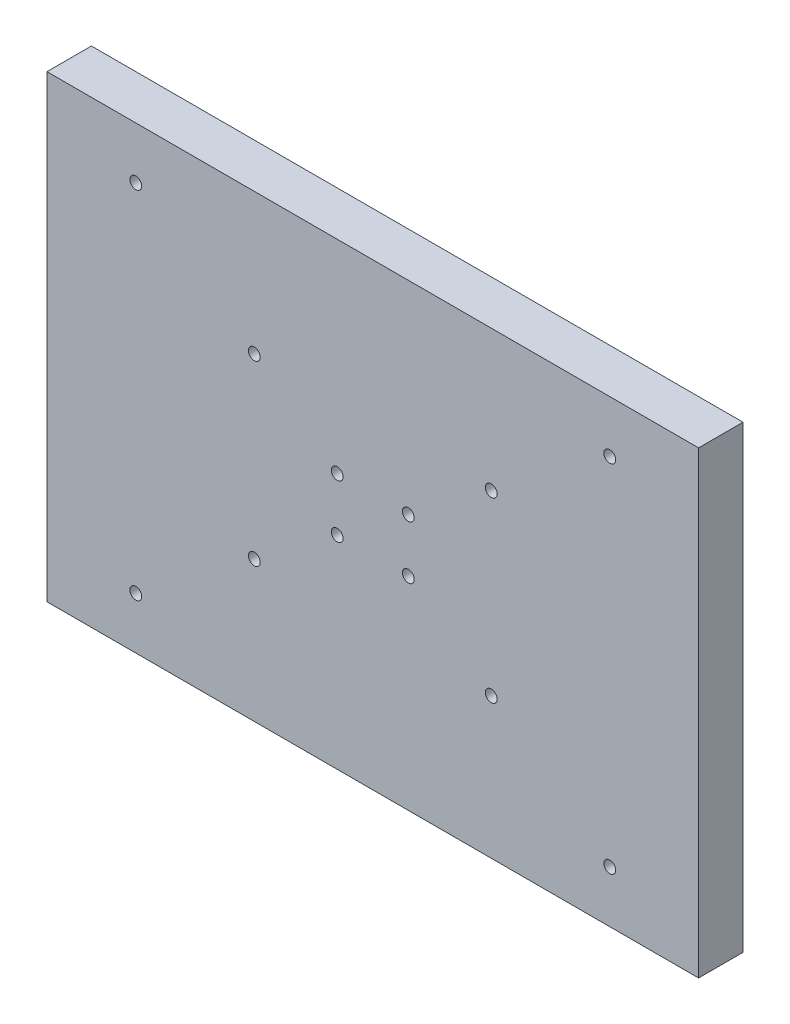
ISO-10303-21;
HEADER;
FILE_DESCRIPTION(('STEP AP214'),'2;1');
FILE_NAME('part.step','',(''),(''),'','','');
FILE_SCHEMA(('AUTOMOTIVE_DESIGN { 1 0 10303 214 1 1 1 1 }'));
ENDSEC;
DATA;
#1=APPLICATION_CONTEXT('core data for automotive mechanical design processes');
#2=APPLICATION_PROTOCOL_DEFINITION('international standard','automotive_design',2000,#1);
#3=PRODUCT_CONTEXT('',#1,'mechanical');
#4=PRODUCT('Part','Part','',(#3));
#5=PRODUCT_RELATED_PRODUCT_CATEGORY('part','',(#4));
#6=PRODUCT_DEFINITION_FORMATION('','',#4);
#7=PRODUCT_DEFINITION_CONTEXT('part definition',#1,'design');
#8=PRODUCT_DEFINITION('design','',#6,#7);
#9=PRODUCT_DEFINITION_SHAPE('','',#8);
#10=(LENGTH_UNIT() NAMED_UNIT(*) SI_UNIT(.MILLI.,.METRE.));
#11=(NAMED_UNIT(*) PLANE_ANGLE_UNIT() SI_UNIT($,.RADIAN.));
#12=(NAMED_UNIT(*) SI_UNIT($,.STERADIAN.) SOLID_ANGLE_UNIT());
#13=UNCERTAINTY_MEASURE_WITH_UNIT(LENGTH_MEASURE(1.E-05),#10,'distance_accuracy_value','');
#14=(GEOMETRIC_REPRESENTATION_CONTEXT(3) GLOBAL_UNCERTAINTY_ASSIGNED_CONTEXT((#13)) GLOBAL_UNIT_ASSIGNED_CONTEXT((#10,
#11,#12)) REPRESENTATION_CONTEXT('',''));
#15=CARTESIAN_POINT('',(0.,0.,0.));
#16=DIRECTION('',(0.,0.,1.));
#17=DIRECTION('',(1.,0.,0.));
#18=AXIS2_PLACEMENT_3D('',#15,#16,#17);
#19=CARTESIAN_POINT('',(0.,0.,15.));
#20=DIRECTION('',(0.,0.,-1.));
#21=DIRECTION('',(-1.,0.,0.));
#22=AXIS2_PLACEMENT_3D('',#19,#20,#21);
#23=PLANE('',#22);
#24=DIRECTION('',(0.,-1.,0.));
#25=VECTOR('',#24,1.);
#26=CARTESIAN_POINT('',(-437.751680005346,-129.877216900672,15.));
#27=LINE('',#26,#25);
#28=CARTESIAN_POINT('',(-437.751680005346,25.1227830993275,15.));
#29=VERTEX_POINT('',#28);
#30=CARTESIAN_POINT('',(-437.751680005346,-129.877216900672,15.));
#31=VERTEX_POINT('',#30);
#32=EDGE_CURVE('E94',#29,#31,#27,.T.);
#33=ORIENTED_EDGE('',*,*,#32,.T.);
#34=DIRECTION('',(1.,0.,0.));
#35=VECTOR('',#34,1.);
#36=CARTESIAN_POINT('',(-437.751680005346,-129.877216900672,15.));
#37=LINE('',#36,#35);
#38=CARTESIAN_POINT('',(-217.751680005346,-129.877216900672,15.));
#39=VERTEX_POINT('',#38);
#40=EDGE_CURVE('E89',#31,#39,#37,.T.);
#41=ORIENTED_EDGE('',*,*,#40,.T.);
#42=DIRECTION('',(0.,1.,0.));
#43=VECTOR('',#42,1.);
#44=CARTESIAN_POINT('',(-217.751680005346,-129.877216900672,15.));
#45=LINE('',#44,#43);
#46=CARTESIAN_POINT('',(-217.751680005346,25.1227830993275,15.));
#47=VERTEX_POINT('',#46);
#48=EDGE_CURVE('E92',#39,#47,#45,.T.);
#49=ORIENTED_EDGE('',*,*,#48,.T.);
#50=DIRECTION('',(-1.,0.,0.));
#51=VECTOR('',#50,1.);
#52=CARTESIAN_POINT('',(-437.751680005346,25.1227830993275,15.));
#53=LINE('',#52,#51);
#54=EDGE_CURVE('E59',#47,#29,#53,.T.);
#55=ORIENTED_EDGE('',*,*,#54,.T.);
#56=EDGE_LOOP('',(#33,#41,#49,#55));
#57=FACE_BOUND('',#56,.T.);
#58=CARTESIAN_POINT('',(-247.751680005346,-112.377216900672,15.));
#59=DIRECTION('',(0.,0.,1.));
#60=DIRECTION('',(1.,0.,0.));
#61=AXIS2_PLACEMENT_3D('',#58,#59,#60);
#62=CIRCLE('',#61,2.);
#63=CARTESIAN_POINT('',(-245.751680005346,-112.377216900672,15.));
#64=VERTEX_POINT('',#63);
#65=EDGE_CURVE('E109',#64,#64,#62,.T.);
#66=ORIENTED_EDGE('',*,*,#65,.F.);
#67=EDGE_LOOP('',(#66));
#68=FACE_BOUND('',#67,.T.);
#69=CARTESIAN_POINT('',(-367.751680005346,-82.3772169006725,15.));
#70=DIRECTION('',(0.,0.,1.));
#71=DIRECTION('',(-1.,0.,0.));
#72=AXIS2_PLACEMENT_3D('',#69,#70,#71);
#73=CIRCLE('',#72,2.);
#74=CARTESIAN_POINT('',(-369.751680005346,-82.3772169006725,15.));
#75=VERTEX_POINT('',#74);
#76=EDGE_CURVE('E124',#75,#75,#73,.T.);
#77=ORIENTED_EDGE('',*,*,#76,.F.);
#78=EDGE_LOOP('',(#77));
#79=FACE_BOUND('',#78,.T.);
#80=CARTESIAN_POINT('',(-407.751680005346,-112.377216900672,15.));
#81=DIRECTION('',(0.,0.,1.));
#82=DIRECTION('',(-1.,0.,0.));
#83=AXIS2_PLACEMENT_3D('',#80,#81,#82);
#84=CIRCLE('',#83,2.);
#85=CARTESIAN_POINT('',(-409.751680005346,-112.377216900672,15.));
#86=VERTEX_POINT('',#85);
#87=EDGE_CURVE('E130',#86,#86,#84,.T.);
#88=ORIENTED_EDGE('',*,*,#87,.F.);
#89=EDGE_LOOP('',(#88));
#90=FACE_BOUND('',#89,.T.);
#91=CARTESIAN_POINT('',(-247.751680005346,7.62278309932751,15.));
#92=DIRECTION('',(0.,0.,1.));
#93=DIRECTION('',(-1.,0.,0.));
#94=AXIS2_PLACEMENT_3D('',#91,#92,#93);
#95=CIRCLE('',#94,2.);
#96=CARTESIAN_POINT('',(-249.751680005346,7.62278309932751,15.));
#97=VERTEX_POINT('',#96);
#98=EDGE_CURVE('E136',#97,#97,#95,.T.);
#99=ORIENTED_EDGE('',*,*,#98,.F.);
#100=EDGE_LOOP('',(#99));
#101=FACE_BOUND('',#100,.T.);
#102=CARTESIAN_POINT('',(-287.751680005346,-22.3772169006725,15.));
#103=DIRECTION('',(0.,0.,1.));
#104=DIRECTION('',(-1.,0.,0.));
#105=AXIS2_PLACEMENT_3D('',#102,#103,#104);
#106=CIRCLE('',#105,2.);
#107=CARTESIAN_POINT('',(-289.751680005346,-22.3772169006725,15.));
#108=VERTEX_POINT('',#107);
#109=EDGE_CURVE('E142',#108,#108,#106,.T.);
#110=ORIENTED_EDGE('',*,*,#109,.F.);
#111=EDGE_LOOP('',(#110));
#112=FACE_BOUND('',#111,.T.);
#113=CARTESIAN_POINT('',(-407.751680005346,7.62278309932751,15.));
#114=DIRECTION('',(0.,0.,1.));
#115=DIRECTION('',(1.,0.,0.));
#116=AXIS2_PLACEMENT_3D('',#113,#114,#115);
#117=CIRCLE('',#116,2.);
#118=CARTESIAN_POINT('',(-405.751680005346,7.62278309932751,15.));
#119=VERTEX_POINT('',#118);
#120=EDGE_CURVE('E148',#119,#119,#117,.T.);
#121=ORIENTED_EDGE('',*,*,#120,.F.);
#122=EDGE_LOOP('',(#121));
#123=FACE_BOUND('',#122,.T.);
#124=CARTESIAN_POINT('',(-315.751680005346,-61.3772169006725,15.));
#125=DIRECTION('',(0.,0.,1.));
#126=DIRECTION('',(1.,0.,0.));
#127=AXIS2_PLACEMENT_3D('',#124,#125,#126);
#128=CIRCLE('',#127,2.);
#129=CARTESIAN_POINT('',(-313.751680005346,-61.3772169006725,15.));
#130=VERTEX_POINT('',#129);
#131=EDGE_CURVE('E154',#130,#130,#128,.T.);
#132=ORIENTED_EDGE('',*,*,#131,.F.);
#133=EDGE_LOOP('',(#132));
#134=FACE_BOUND('',#133,.T.);
#135=CARTESIAN_POINT('',(-339.751680005346,-61.3772169006725,15.));
#136=DIRECTION('',(0.,0.,1.));
#137=DIRECTION('',(1.,0.,0.));
#138=AXIS2_PLACEMENT_3D('',#135,#136,#137);
#139=CIRCLE('',#138,2.);
#140=CARTESIAN_POINT('',(-337.751680005346,-61.3772169006725,15.));
#141=VERTEX_POINT('',#140);
#142=EDGE_CURVE('E160',#141,#141,#139,.T.);
#143=ORIENTED_EDGE('',*,*,#142,.F.);
#144=EDGE_LOOP('',(#143));
#145=FACE_BOUND('',#144,.T.);
#146=CARTESIAN_POINT('',(-287.751680005346,-82.3772169006725,15.));
#147=DIRECTION('',(0.,0.,1.));
#148=DIRECTION('',(1.,0.,0.));
#149=AXIS2_PLACEMENT_3D('',#146,#147,#148);
#150=CIRCLE('',#149,2.);
#151=CARTESIAN_POINT('',(-285.751680005346,-82.3772169006725,15.));
#152=VERTEX_POINT('',#151);
#153=EDGE_CURVE('E166',#152,#152,#150,.T.);
#154=ORIENTED_EDGE('',*,*,#153,.F.);
#155=EDGE_LOOP('',(#154));
#156=FACE_BOUND('',#155,.T.);
#157=CARTESIAN_POINT('',(-315.751680005346,-43.3772169006725,15.));
#158=DIRECTION('',(0.,0.,1.));
#159=DIRECTION('',(1.,0.,0.));
#160=AXIS2_PLACEMENT_3D('',#157,#158,#159);
#161=CIRCLE('',#160,2.);
#162=CARTESIAN_POINT('',(-313.751680005346,-43.3772169006725,15.));
#163=VERTEX_POINT('',#162);
#164=EDGE_CURVE('E172',#163,#163,#161,.T.);
#165=ORIENTED_EDGE('',*,*,#164,.F.);
#166=EDGE_LOOP('',(#165));
#167=FACE_BOUND('',#166,.T.);
#168=CARTESIAN_POINT('',(-339.751680005346,-43.3772169006725,15.));
#169=DIRECTION('',(0.,0.,1.));
#170=DIRECTION('',(1.,0.,0.));
#171=AXIS2_PLACEMENT_3D('',#168,#169,#170);
#172=CIRCLE('',#171,2.);
#173=CARTESIAN_POINT('',(-337.751680005346,-43.3772169006725,15.));
#174=VERTEX_POINT('',#173);
#175=EDGE_CURVE('E178',#174,#174,#172,.T.);
#176=ORIENTED_EDGE('',*,*,#175,.F.);
#177=EDGE_LOOP('',(#176));
#178=FACE_BOUND('',#177,.T.);
#179=CARTESIAN_POINT('',(-367.751680005346,-22.3772169006725,15.));
#180=DIRECTION('',(0.,0.,1.));
#181=DIRECTION('',(1.,0.,0.));
#182=AXIS2_PLACEMENT_3D('',#179,#180,#181);
#183=CIRCLE('',#182,2.);
#184=CARTESIAN_POINT('',(-365.751680005346,-22.3772169006725,15.));
#185=VERTEX_POINT('',#184);
#186=EDGE_CURVE('E184',#185,#185,#183,.T.);
#187=ORIENTED_EDGE('',*,*,#186,.F.);
#188=EDGE_LOOP('',(#187));
#189=FACE_BOUND('',#188,.T.);
#190=ADVANCED_FACE('F42',(#57,#68,#79,#90,#101,#112,#123,#134,#145,#156,#167,#178,#189),#23,.F.);
#191=CARTESIAN_POINT('',(0.,0.,0.));
#192=DIRECTION('',(0.,0.,-1.));
#193=DIRECTION('',(-1.,0.,0.));
#194=AXIS2_PLACEMENT_3D('',#191,#192,#193);
#195=PLANE('',#194);
#196=CARTESIAN_POINT('',(-339.751680005346,-43.3772169006725,0.));
#197=DIRECTION('',(0.,0.,1.));
#198=DIRECTION('',(1.,0.,0.));
#199=AXIS2_PLACEMENT_3D('',#196,#197,#198);
#200=CIRCLE('',#199,2.);
#201=CARTESIAN_POINT('',(-337.751680005346,-43.3772169006725,0.));
#202=VERTEX_POINT('',#201);
#203=EDGE_CURVE('E181',#202,#202,#200,.T.);
#204=ORIENTED_EDGE('',*,*,#203,.T.);
#205=EDGE_LOOP('',(#204));
#206=FACE_BOUND('',#205,.T.);
#207=CARTESIAN_POINT('',(-287.751680005346,-82.3772169006725,0.));
#208=DIRECTION('',(0.,0.,1.));
#209=DIRECTION('',(1.,0.,0.));
#210=AXIS2_PLACEMENT_3D('',#207,#208,#209);
#211=CIRCLE('',#210,2.);
#212=CARTESIAN_POINT('',(-285.751680005346,-82.3772169006725,0.));
#213=VERTEX_POINT('',#212);
#214=EDGE_CURVE('E169',#213,#213,#211,.T.);
#215=ORIENTED_EDGE('',*,*,#214,.T.);
#216=EDGE_LOOP('',(#215));
#217=FACE_BOUND('',#216,.T.);
#218=CARTESIAN_POINT('',(-315.751680005346,-61.3772169006725,0.));
#219=DIRECTION('',(0.,0.,1.));
#220=DIRECTION('',(1.,0.,0.));
#221=AXIS2_PLACEMENT_3D('',#218,#219,#220);
#222=CIRCLE('',#221,2.);
#223=CARTESIAN_POINT('',(-313.751680005346,-61.3772169006725,0.));
#224=VERTEX_POINT('',#223);
#225=EDGE_CURVE('E157',#224,#224,#222,.T.);
#226=ORIENTED_EDGE('',*,*,#225,.T.);
#227=EDGE_LOOP('',(#226));
#228=FACE_BOUND('',#227,.T.);
#229=CARTESIAN_POINT('',(-287.751680005346,-22.3772169006725,0.));
#230=DIRECTION('',(0.,0.,1.));
#231=DIRECTION('',(-1.,0.,0.));
#232=AXIS2_PLACEMENT_3D('',#229,#230,#231);
#233=CIRCLE('',#232,2.);
#234=CARTESIAN_POINT('',(-289.751680005346,-22.3772169006725,0.));
#235=VERTEX_POINT('',#234);
#236=EDGE_CURVE('E145',#235,#235,#233,.T.);
#237=ORIENTED_EDGE('',*,*,#236,.T.);
#238=EDGE_LOOP('',(#237));
#239=FACE_BOUND('',#238,.T.);
#240=CARTESIAN_POINT('',(-407.751680005346,-112.377216900672,0.));
#241=DIRECTION('',(0.,0.,1.));
#242=DIRECTION('',(-1.,0.,0.));
#243=AXIS2_PLACEMENT_3D('',#240,#241,#242);
#244=CIRCLE('',#243,2.);
#245=CARTESIAN_POINT('',(-409.751680005346,-112.377216900672,0.));
#246=VERTEX_POINT('',#245);
#247=EDGE_CURVE('E133',#246,#246,#244,.T.);
#248=ORIENTED_EDGE('',*,*,#247,.T.);
#249=EDGE_LOOP('',(#248));
#250=FACE_BOUND('',#249,.T.);
#251=CARTESIAN_POINT('',(-247.751680005346,-112.377216900672,0.));
#252=DIRECTION('',(0.,0.,1.));
#253=DIRECTION('',(1.,0.,0.));
#254=AXIS2_PLACEMENT_3D('',#251,#252,#253);
#255=CIRCLE('',#254,2.);
#256=CARTESIAN_POINT('',(-245.751680005346,-112.377216900672,0.));
#257=VERTEX_POINT('',#256);
#258=EDGE_CURVE('E121',#257,#257,#255,.T.);
#259=ORIENTED_EDGE('',*,*,#258,.T.);
#260=EDGE_LOOP('',(#259));
#261=FACE_BOUND('',#260,.T.);
#262=DIRECTION('',(0.,-1.,0.));
#263=VECTOR('',#262,1.);
#264=CARTESIAN_POINT('',(-437.751680005346,-129.877216900672,0.));
#265=LINE('',#264,#263);
#266=CARTESIAN_POINT('',(-437.751680005346,25.1227830993275,0.));
#267=VERTEX_POINT('',#266);
#268=CARTESIAN_POINT('',(-437.751680005346,-129.877216900672,0.));
#269=VERTEX_POINT('',#268);
#270=EDGE_CURVE('E106',#267,#269,#265,.T.);
#271=ORIENTED_EDGE('',*,*,#270,.F.);
#272=DIRECTION('',(-1.,0.,0.));
#273=VECTOR('',#272,1.);
#274=CARTESIAN_POINT('',(-437.751680005346,25.1227830993275,0.));
#275=LINE('',#274,#273);
#276=CARTESIAN_POINT('',(-217.751680005346,25.1227830993275,0.));
#277=VERTEX_POINT('',#276);
#278=EDGE_CURVE('E82',#277,#267,#275,.T.);
#279=ORIENTED_EDGE('',*,*,#278,.F.);
#280=DIRECTION('',(0.,1.,0.));
#281=VECTOR('',#280,1.);
#282=CARTESIAN_POINT('',(-217.751680005346,-129.877216900672,0.));
#283=LINE('',#282,#281);
#284=CARTESIAN_POINT('',(-217.751680005346,-129.877216900672,0.));
#285=VERTEX_POINT('',#284);
#286=EDGE_CURVE('E76',#285,#277,#283,.T.);
#287=ORIENTED_EDGE('',*,*,#286,.F.);
#288=DIRECTION('',(1.,0.,0.));
#289=VECTOR('',#288,1.);
#290=CARTESIAN_POINT('',(-437.751680005346,-129.877216900672,0.));
#291=LINE('',#290,#289);
#292=EDGE_CURVE('E98',#269,#285,#291,.T.);
#293=ORIENTED_EDGE('',*,*,#292,.F.);
#294=EDGE_LOOP('',(#271,#279,#287,#293));
#295=FACE_BOUND('',#294,.T.);
#296=CARTESIAN_POINT('',(-367.751680005346,-82.3772169006725,0.));
#297=DIRECTION('',(0.,0.,1.));
#298=DIRECTION('',(-1.,0.,0.));
#299=AXIS2_PLACEMENT_3D('',#296,#297,#298);
#300=CIRCLE('',#299,2.);
#301=CARTESIAN_POINT('',(-369.751680005346,-82.3772169006725,0.));
#302=VERTEX_POINT('',#301);
#303=EDGE_CURVE('E127',#302,#302,#300,.T.);
#304=ORIENTED_EDGE('',*,*,#303,.T.);
#305=EDGE_LOOP('',(#304));
#306=FACE_BOUND('',#305,.T.);
#307=CARTESIAN_POINT('',(-247.751680005346,7.62278309932751,0.));
#308=DIRECTION('',(0.,0.,1.));
#309=DIRECTION('',(-1.,0.,0.));
#310=AXIS2_PLACEMENT_3D('',#307,#308,#309);
#311=CIRCLE('',#310,2.);
#312=CARTESIAN_POINT('',(-249.751680005346,7.62278309932751,0.));
#313=VERTEX_POINT('',#312);
#314=EDGE_CURVE('E139',#313,#313,#311,.T.);
#315=ORIENTED_EDGE('',*,*,#314,.T.);
#316=EDGE_LOOP('',(#315));
#317=FACE_BOUND('',#316,.T.);
#318=CARTESIAN_POINT('',(-407.751680005346,7.62278309932751,0.));
#319=DIRECTION('',(0.,0.,1.));
#320=DIRECTION('',(1.,0.,0.));
#321=AXIS2_PLACEMENT_3D('',#318,#319,#320);
#322=CIRCLE('',#321,2.);
#323=CARTESIAN_POINT('',(-405.751680005346,7.62278309932751,0.));
#324=VERTEX_POINT('',#323);
#325=EDGE_CURVE('E151',#324,#324,#322,.T.);
#326=ORIENTED_EDGE('',*,*,#325,.T.);
#327=EDGE_LOOP('',(#326));
#328=FACE_BOUND('',#327,.T.);
#329=CARTESIAN_POINT('',(-339.751680005346,-61.3772169006725,0.));
#330=DIRECTION('',(0.,0.,1.));
#331=DIRECTION('',(1.,0.,0.));
#332=AXIS2_PLACEMENT_3D('',#329,#330,#331);
#333=CIRCLE('',#332,2.);
#334=CARTESIAN_POINT('',(-337.751680005346,-61.3772169006725,0.));
#335=VERTEX_POINT('',#334);
#336=EDGE_CURVE('E163',#335,#335,#333,.T.);
#337=ORIENTED_EDGE('',*,*,#336,.T.);
#338=EDGE_LOOP('',(#337));
#339=FACE_BOUND('',#338,.T.);
#340=CARTESIAN_POINT('',(-315.751680005346,-43.3772169006725,0.));
#341=DIRECTION('',(0.,0.,1.));
#342=DIRECTION('',(1.,0.,0.));
#343=AXIS2_PLACEMENT_3D('',#340,#341,#342);
#344=CIRCLE('',#343,2.);
#345=CARTESIAN_POINT('',(-313.751680005346,-43.3772169006725,0.));
#346=VERTEX_POINT('',#345);
#347=EDGE_CURVE('E175',#346,#346,#344,.T.);
#348=ORIENTED_EDGE('',*,*,#347,.T.);
#349=EDGE_LOOP('',(#348));
#350=FACE_BOUND('',#349,.T.);
#351=CARTESIAN_POINT('',(-367.751680005346,-22.3772169006725,0.));
#352=DIRECTION('',(0.,0.,1.));
#353=DIRECTION('',(1.,0.,0.));
#354=AXIS2_PLACEMENT_3D('',#351,#352,#353);
#355=CIRCLE('',#354,2.);
#356=CARTESIAN_POINT('',(-365.751680005346,-22.3772169006725,0.));
#357=VERTEX_POINT('',#356);
#358=EDGE_CURVE('E187',#357,#357,#355,.T.);
#359=ORIENTED_EDGE('',*,*,#358,.T.);
#360=EDGE_LOOP('',(#359));
#361=FACE_BOUND('',#360,.T.);
#362=ADVANCED_FACE('F117',(#206,#217,#228,#239,#250,#261,#295,#306,#317,#328,#339,#350,#361),
#195,.T.);
#363=CARTESIAN_POINT('',(-437.751680005346,-129.877216900672,15.));
#364=DIRECTION('',(1.,0.,0.));
#365=DIRECTION('',(0.,0.,-1.));
#366=AXIS2_PLACEMENT_3D('',#363,#364,#365);
#367=PLANE('',#366);
#368=ORIENTED_EDGE('',*,*,#270,.T.);
#369=DIRECTION('',(0.,0.,-1.));
#370=VECTOR('',#369,1.);
#371=CARTESIAN_POINT('',(-437.751680005346,-129.877216900672,15.));
#372=LINE('',#371,#370);
#373=EDGE_CURVE('E13',#31,#269,#372,.T.);
#374=ORIENTED_EDGE('',*,*,#373,.F.);
#375=ORIENTED_EDGE('',*,*,#32,.F.);
#376=DIRECTION('',(0.,0.,-1.));
#377=VECTOR('',#376,1.);
#378=CARTESIAN_POINT('',(-437.751680005346,25.1227830993275,15.));
#379=LINE('',#378,#377);
#380=EDGE_CURVE('E102',#29,#267,#379,.T.);
#381=ORIENTED_EDGE('',*,*,#380,.T.);
#382=EDGE_LOOP('',(#368,#374,#375,#381));
#383=FACE_BOUND('',#382,.T.);
#384=ADVANCED_FACE('F44',(#383),#367,.F.);
#385=CARTESIAN_POINT('',(-437.751680005346,-129.877216900672,15.));
#386=DIRECTION('',(0.,1.,0.));
#387=DIRECTION('',(0.,0.,1.));
#388=AXIS2_PLACEMENT_3D('',#385,#386,#387);
#389=PLANE('',#388);
#390=ORIENTED_EDGE('',*,*,#292,.T.);
#391=DIRECTION('',(0.,0.,-1.));
#392=VECTOR('',#391,1.);
#393=CARTESIAN_POINT('',(-217.751680005346,-129.877216900672,15.));
#394=LINE('',#393,#392);
#395=EDGE_CURVE('E51',#39,#285,#394,.T.);
#396=ORIENTED_EDGE('',*,*,#395,.F.);
#397=ORIENTED_EDGE('',*,*,#40,.F.);
#398=ORIENTED_EDGE('',*,*,#373,.T.);
#399=EDGE_LOOP('',(#390,#396,#397,#398));
#400=FACE_BOUND('',#399,.T.);
#401=ADVANCED_FACE('F97',(#400),#389,.F.);
#402=CARTESIAN_POINT('',(-217.751680005346,-129.877216900672,15.));
#403=DIRECTION('',(-1.,0.,0.));
#404=DIRECTION('',(0.,0.,1.));
#405=AXIS2_PLACEMENT_3D('',#402,#403,#404);
#406=PLANE('',#405);
#407=ORIENTED_EDGE('',*,*,#286,.T.);
#408=DIRECTION('',(0.,0.,-1.));
#409=VECTOR('',#408,1.);
#410=CARTESIAN_POINT('',(-217.751680005346,25.1227830993275,15.));
#411=LINE('',#410,#409);
#412=EDGE_CURVE('E99',#47,#277,#411,.T.);
#413=ORIENTED_EDGE('',*,*,#412,.F.);
#414=ORIENTED_EDGE('',*,*,#48,.F.);
#415=ORIENTED_EDGE('',*,*,#395,.T.);
#416=EDGE_LOOP('',(#407,#413,#414,#415));
#417=FACE_BOUND('',#416,.T.);
#418=ADVANCED_FACE('F100',(#417),#406,.F.);
#419=CARTESIAN_POINT('',(-437.751680005346,25.1227830993275,15.));
#420=DIRECTION('',(0.,-1.,0.));
#421=DIRECTION('',(0.,0.,-1.));
#422=AXIS2_PLACEMENT_3D('',#419,#420,#421);
#423=PLANE('',#422);
#424=ORIENTED_EDGE('',*,*,#278,.T.);
#425=ORIENTED_EDGE('',*,*,#380,.F.);
#426=ORIENTED_EDGE('',*,*,#54,.F.);
#427=ORIENTED_EDGE('',*,*,#412,.T.);
#428=EDGE_LOOP('',(#424,#425,#426,#427));
#429=FACE_BOUND('',#428,.T.);
#430=ADVANCED_FACE('F114',(#429),#423,.F.);
#431=CARTESIAN_POINT('',(-247.751680005346,-112.377216900672,15.));
#432=DIRECTION('',(0.,0.,-1.));
#433=DIRECTION('',(-1.,0.,0.));
#434=AXIS2_PLACEMENT_3D('',#431,#432,#433);
#435=CYLINDRICAL_SURFACE('',#434,2.);
#436=ORIENTED_EDGE('',*,*,#65,.T.);
#437=EDGE_LOOP('',(#436));
#438=FACE_BOUND('',#437,.T.);
#439=ORIENTED_EDGE('',*,*,#258,.F.);
#440=EDGE_LOOP('',(#439));
#441=FACE_BOUND('',#440,.T.);
#442=ADVANCED_FACE('F204',(#438,#441),#435,.F.);
#443=CARTESIAN_POINT('',(-367.751680005346,-82.3772169006725,15.));
#444=DIRECTION('',(0.,0.,-1.));
#445=DIRECTION('',(-1.,0.,0.));
#446=AXIS2_PLACEMENT_3D('',#443,#444,#445);
#447=CYLINDRICAL_SURFACE('',#446,2.);
#448=ORIENTED_EDGE('',*,*,#76,.T.);
#449=EDGE_LOOP('',(#448));
#450=FACE_BOUND('',#449,.T.);
#451=ORIENTED_EDGE('',*,*,#303,.F.);
#452=EDGE_LOOP('',(#451));
#453=FACE_BOUND('',#452,.T.);
#454=ADVANCED_FACE('F250',(#450,#453),#447,.F.);
#455=CARTESIAN_POINT('',(-407.751680005346,-112.377216900672,15.));
#456=DIRECTION('',(0.,0.,-1.));
#457=DIRECTION('',(-1.,0.,0.));
#458=AXIS2_PLACEMENT_3D('',#455,#456,#457);
#459=CYLINDRICAL_SURFACE('',#458,2.);
#460=ORIENTED_EDGE('',*,*,#87,.T.);
#461=EDGE_LOOP('',(#460));
#462=FACE_BOUND('',#461,.T.);
#463=ORIENTED_EDGE('',*,*,#247,.F.);
#464=EDGE_LOOP('',(#463));
#465=FACE_BOUND('',#464,.T.);
#466=ADVANCED_FACE('F258',(#462,#465),#459,.F.);
#467=CARTESIAN_POINT('',(-247.751680005346,7.62278309932751,15.));
#468=DIRECTION('',(0.,0.,-1.));
#469=DIRECTION('',(-1.,0.,0.));
#470=AXIS2_PLACEMENT_3D('',#467,#468,#469);
#471=CYLINDRICAL_SURFACE('',#470,2.);
#472=ORIENTED_EDGE('',*,*,#98,.T.);
#473=EDGE_LOOP('',(#472));
#474=FACE_BOUND('',#473,.T.);
#475=ORIENTED_EDGE('',*,*,#314,.F.);
#476=EDGE_LOOP('',(#475));
#477=FACE_BOUND('',#476,.T.);
#478=ADVANCED_FACE('F266',(#474,#477),#471,.F.);
#479=CARTESIAN_POINT('',(-287.751680005346,-22.3772169006725,15.));
#480=DIRECTION('',(0.,0.,-1.));
#481=DIRECTION('',(-1.,0.,0.));
#482=AXIS2_PLACEMENT_3D('',#479,#480,#481);
#483=CYLINDRICAL_SURFACE('',#482,2.);
#484=ORIENTED_EDGE('',*,*,#109,.T.);
#485=EDGE_LOOP('',(#484));
#486=FACE_BOUND('',#485,.T.);
#487=ORIENTED_EDGE('',*,*,#236,.F.);
#488=EDGE_LOOP('',(#487));
#489=FACE_BOUND('',#488,.T.);
#490=ADVANCED_FACE('F275',(#486,#489),#483,.F.);
#491=CARTESIAN_POINT('',(-407.751680005346,7.62278309932751,15.));
#492=DIRECTION('',(0.,0.,-1.));
#493=DIRECTION('',(-1.,0.,0.));
#494=AXIS2_PLACEMENT_3D('',#491,#492,#493);
#495=CYLINDRICAL_SURFACE('',#494,2.);
#496=ORIENTED_EDGE('',*,*,#120,.T.);
#497=EDGE_LOOP('',(#496));
#498=FACE_BOUND('',#497,.T.);
#499=ORIENTED_EDGE('',*,*,#325,.F.);
#500=EDGE_LOOP('',(#499));
#501=FACE_BOUND('',#500,.T.);
#502=ADVANCED_FACE('F284',(#498,#501),#495,.F.);
#503=CARTESIAN_POINT('',(-315.751680005346,-61.3772169006725,15.));
#504=DIRECTION('',(0.,0.,-1.));
#505=DIRECTION('',(-1.,0.,0.));
#506=AXIS2_PLACEMENT_3D('',#503,#504,#505);
#507=CYLINDRICAL_SURFACE('',#506,2.);
#508=ORIENTED_EDGE('',*,*,#131,.T.);
#509=EDGE_LOOP('',(#508));
#510=FACE_BOUND('',#509,.T.);
#511=ORIENTED_EDGE('',*,*,#225,.F.);
#512=EDGE_LOOP('',(#511));
#513=FACE_BOUND('',#512,.T.);
#514=ADVANCED_FACE('F293',(#510,#513),#507,.F.);
#515=CARTESIAN_POINT('',(-339.751680005346,-61.3772169006725,15.));
#516=DIRECTION('',(0.,0.,-1.));
#517=DIRECTION('',(-1.,0.,0.));
#518=AXIS2_PLACEMENT_3D('',#515,#516,#517);
#519=CYLINDRICAL_SURFACE('',#518,2.);
#520=ORIENTED_EDGE('',*,*,#142,.T.);
#521=EDGE_LOOP('',(#520));
#522=FACE_BOUND('',#521,.T.);
#523=ORIENTED_EDGE('',*,*,#336,.F.);
#524=EDGE_LOOP('',(#523));
#525=FACE_BOUND('',#524,.T.);
#526=ADVANCED_FACE('F302',(#522,#525),#519,.F.);
#527=CARTESIAN_POINT('',(-287.751680005346,-82.3772169006725,15.));
#528=DIRECTION('',(0.,0.,-1.));
#529=DIRECTION('',(-1.,0.,0.));
#530=AXIS2_PLACEMENT_3D('',#527,#528,#529);
#531=CYLINDRICAL_SURFACE('',#530,2.);
#532=ORIENTED_EDGE('',*,*,#153,.T.);
#533=EDGE_LOOP('',(#532));
#534=FACE_BOUND('',#533,.T.);
#535=ORIENTED_EDGE('',*,*,#214,.F.);
#536=EDGE_LOOP('',(#535));
#537=FACE_BOUND('',#536,.T.);
#538=ADVANCED_FACE('F311',(#534,#537),#531,.F.);
#539=CARTESIAN_POINT('',(-315.751680005346,-43.3772169006725,15.));
#540=DIRECTION('',(0.,0.,-1.));
#541=DIRECTION('',(-1.,0.,0.));
#542=AXIS2_PLACEMENT_3D('',#539,#540,#541);
#543=CYLINDRICAL_SURFACE('',#542,2.);
#544=ORIENTED_EDGE('',*,*,#164,.T.);
#545=EDGE_LOOP('',(#544));
#546=FACE_BOUND('',#545,.T.);
#547=ORIENTED_EDGE('',*,*,#347,.F.);
#548=EDGE_LOOP('',(#547));
#549=FACE_BOUND('',#548,.T.);
#550=ADVANCED_FACE('F320',(#546,#549),#543,.F.);
#551=CARTESIAN_POINT('',(-339.751680005346,-43.3772169006725,15.));
#552=DIRECTION('',(0.,0.,-1.));
#553=DIRECTION('',(-1.,0.,0.));
#554=AXIS2_PLACEMENT_3D('',#551,#552,#553);
#555=CYLINDRICAL_SURFACE('',#554,2.);
#556=ORIENTED_EDGE('',*,*,#175,.T.);
#557=EDGE_LOOP('',(#556));
#558=FACE_BOUND('',#557,.T.);
#559=ORIENTED_EDGE('',*,*,#203,.F.);
#560=EDGE_LOOP('',(#559));
#561=FACE_BOUND('',#560,.T.);
#562=ADVANCED_FACE('F329',(#558,#561),#555,.F.);
#563=CARTESIAN_POINT('',(-367.751680005346,-22.3772169006725,15.));
#564=DIRECTION('',(0.,0.,-1.));
#565=DIRECTION('',(-1.,0.,0.));
#566=AXIS2_PLACEMENT_3D('',#563,#564,#565);
#567=CYLINDRICAL_SURFACE('',#566,2.);
#568=ORIENTED_EDGE('',*,*,#186,.T.);
#569=EDGE_LOOP('',(#568));
#570=FACE_BOUND('',#569,.T.);
#571=ORIENTED_EDGE('',*,*,#358,.F.);
#572=EDGE_LOOP('',(#571));
#573=FACE_BOUND('',#572,.T.);
#574=ADVANCED_FACE('F193',(#570,#573),#567,.F.);
#575=CLOSED_SHELL('',(#190,#362,#384,#401,#418,#430,#442,#454,#466,#478,#490,#502,#514,#526,
#538,#550,#562,#574));
#576=MANIFOLD_SOLID_BREP('B2',#575);
#577=ADVANCED_BREP_SHAPE_REPRESENTATION('',(#18,#576),#14);
#578=SHAPE_DEFINITION_REPRESENTATION(#9,#577);
ENDSEC;
END-ISO-10303-21;
